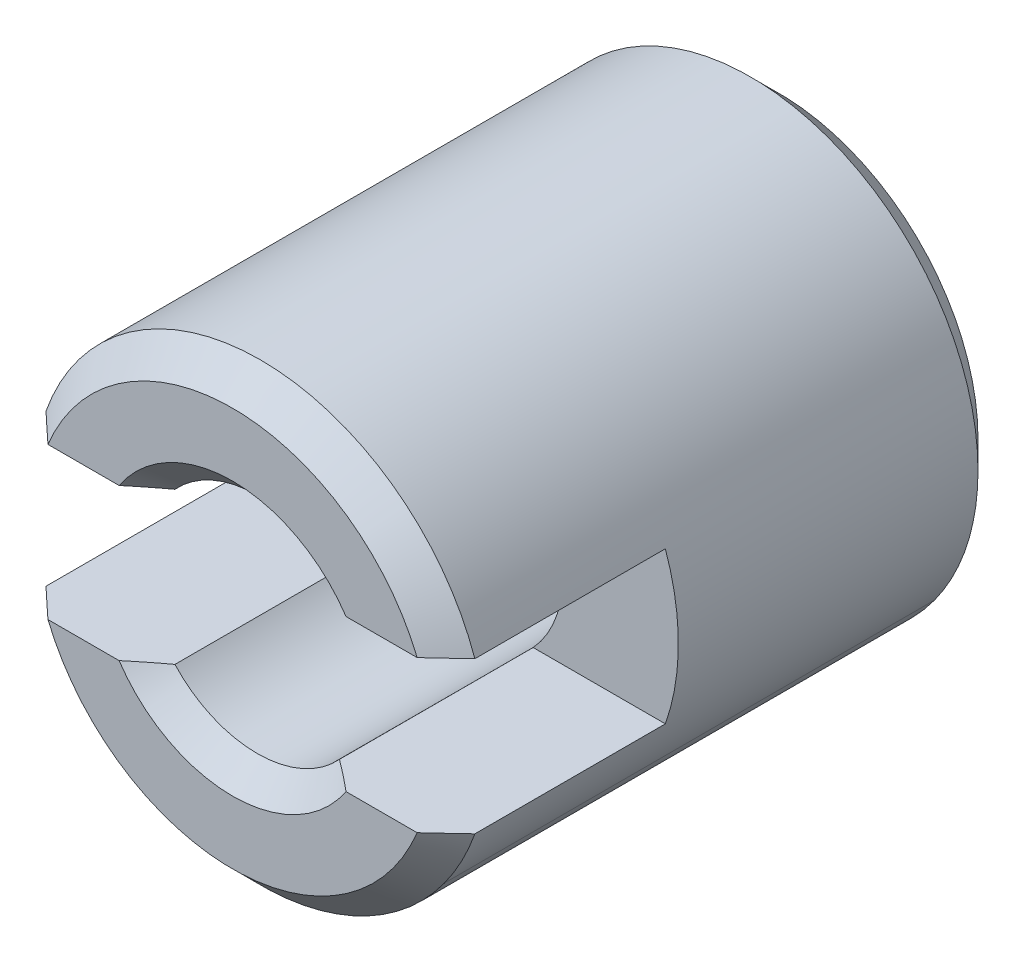
ISO-10303-21;
HEADER;
FILE_DESCRIPTION(('STEP AP214'),'2;1');
FILE_NAME('part.step','',(''),(''),'','','');
FILE_SCHEMA(('AUTOMOTIVE_DESIGN { 1 0 10303 214 1 1 1 1 }'));
ENDSEC;
DATA;
#1=APPLICATION_CONTEXT('core data for automotive mechanical design processes');
#2=APPLICATION_PROTOCOL_DEFINITION('international standard','automotive_design',2000,#1);
#3=PRODUCT_CONTEXT('',#1,'mechanical');
#4=PRODUCT('Part','Part','',(#3));
#5=PRODUCT_RELATED_PRODUCT_CATEGORY('part','',(#4));
#6=PRODUCT_DEFINITION_FORMATION('','',#4);
#7=PRODUCT_DEFINITION_CONTEXT('part definition',#1,'design');
#8=PRODUCT_DEFINITION('design','',#6,#7);
#9=PRODUCT_DEFINITION_SHAPE('','',#8);
#10=(LENGTH_UNIT() NAMED_UNIT(*) SI_UNIT(.MILLI.,.METRE.));
#11=(NAMED_UNIT(*) PLANE_ANGLE_UNIT() SI_UNIT($,.RADIAN.));
#12=(NAMED_UNIT(*) SI_UNIT($,.STERADIAN.) SOLID_ANGLE_UNIT());
#13=UNCERTAINTY_MEASURE_WITH_UNIT(LENGTH_MEASURE(1.E-05),#10,'distance_accuracy_value','');
#14=(GEOMETRIC_REPRESENTATION_CONTEXT(3) GLOBAL_UNCERTAINTY_ASSIGNED_CONTEXT((#13)) GLOBAL_UNIT_ASSIGNED_CONTEXT((#10,
#11,#12)) REPRESENTATION_CONTEXT('',''));
#15=CARTESIAN_POINT('',(0.,0.,0.));
#16=DIRECTION('',(0.,0.,1.));
#17=DIRECTION('',(1.,0.,0.));
#18=AXIS2_PLACEMENT_3D('',#15,#16,#17);
#19=CARTESIAN_POINT('',(0.,0.,3.));
#20=DIRECTION('',(0.,0.,-1.));
#21=DIRECTION('',(-1.,0.,0.));
#22=AXIS2_PLACEMENT_3D('',#19,#20,#21);
#23=PLANE('',#22);
#24=CARTESIAN_POINT('',(0.,0.,3.));
#25=DIRECTION('',(0.,0.,-1.));
#26=DIRECTION('',(-1.,0.,0.));
#27=AXIS2_PLACEMENT_3D('',#24,#25,#26);
#28=CIRCLE('',#27,2.1935);
#29=CARTESIAN_POINT('',(-2.0290386407251,0.83333333333333,3.));
#30=VERTEX_POINT('',#29);
#31=CARTESIAN_POINT('',(2.0290386407251,0.83333333333333,3.));
#32=VERTEX_POINT('',#31);
#33=EDGE_CURVE('E13',#30,#32,#28,.T.);
#34=ORIENTED_EDGE('',*,*,#33,.F.);
#35=DIRECTION('',(-1.,0.,0.));
#36=VECTOR('',#35,1.);
#37=CARTESIAN_POINT('',(3.,0.83333333333333,3.));
#38=LINE('',#37,#36);
#39=CARTESIAN_POINT('',(-1.24721912892465,0.83333333333333,3.));
#40=VERTEX_POINT('',#39);
#41=EDGE_CURVE('E33',#40,#30,#38,.T.);
#42=ORIENTED_EDGE('',*,*,#41,.F.);
#43=CARTESIAN_POINT('',(0.,0.,3.));
#44=DIRECTION('',(0.,0.,-1.));
#45=DIRECTION('',(-1.,0.,0.));
#46=AXIS2_PLACEMENT_3D('',#43,#44,#45);
#47=CIRCLE('',#46,1.5);
#48=CARTESIAN_POINT('',(1.24721912892465,0.83333333333333,3.));
#49=VERTEX_POINT('',#48);
#50=EDGE_CURVE('E296',#40,#49,#47,.T.);
#51=ORIENTED_EDGE('',*,*,#50,.T.);
#52=DIRECTION('',(-1.,0.,0.));
#53=VECTOR('',#52,1.);
#54=CARTESIAN_POINT('',(3.,0.83333333333333,3.));
#55=LINE('',#54,#53);
#56=EDGE_CURVE('E293',#32,#49,#55,.T.);
#57=ORIENTED_EDGE('',*,*,#56,.F.);
#58=EDGE_LOOP('',(#34,#42,#51,#57));
#59=FACE_BOUND('',#58,.T.);
#60=ADVANCED_FACE('F25',(#59),#23,.F.);
#61=CARTESIAN_POINT('',(3.,0.83333333333333,0.6));
#62=DIRECTION('',(0.,1.,0.));
#63=DIRECTION('',(0.,0.,1.));
#64=AXIS2_PLACEMENT_3D('',#61,#62,#63);
#65=PLANE('',#64);
#66=ORIENTED_EDGE('',*,*,#56,.T.);
#67=CARTESIAN_POINT('',(1.24721912892465,0.83333333333333,3.));
#68=CARTESIAN_POINT('',(1.13521834904477,0.83333333333333,2.90687365658622));
#69=CARTESIAN_POINT('',(1.02135791134346,0.83333333333333,2.81578490080694));
#70=CARTESIAN_POINT('',(0.904005423410479,0.83333333333333,2.7295));
#71=B_SPLINE_CURVE_WITH_KNOTS('',3,(#67,#68,#69,#70),.UNSPECIFIED.,.F.,.F.,(4,4),(0.,1.),.UNSPECIFIED.);
#72=CARTESIAN_POINT('',(0.90400542341048,0.83333333333333,2.7295));
#73=VERTEX_POINT('',#72);
#74=EDGE_CURVE('E289',#49,#73,#71,.T.);
#75=ORIENTED_EDGE('',*,*,#74,.T.);
#76=DIRECTION('',(0.,0.,-1.));
#77=VECTOR('',#76,1.);
#78=CARTESIAN_POINT('',(0.90400542341048,0.83333333333333,-3.));
#79=LINE('',#78,#77);
#80=CARTESIAN_POINT('',(0.90400542341048,0.83333333333333,0.6));
#81=VERTEX_POINT('',#80);
#82=EDGE_CURVE('E286',#73,#81,#79,.T.);
#83=ORIENTED_EDGE('',*,*,#82,.T.);
#84=DIRECTION('',(-1.,0.,0.));
#85=VECTOR('',#84,1.);
#86=CARTESIAN_POINT('',(3.,0.83333333333333,0.6));
#87=LINE('',#86,#85);
#88=CARTESIAN_POINT('',(2.35702260395516,0.83333333333333,0.6));
#89=VERTEX_POINT('',#88);
#90=EDGE_CURVE('E281',#89,#81,#87,.T.);
#91=ORIENTED_EDGE('',*,*,#90,.F.);
#92=DIRECTION('',(0.,0.,-1.));
#93=VECTOR('',#92,1.);
#94=CARTESIAN_POINT('',(2.35702260395516,0.83333333333333,-3.));
#95=LINE('',#94,#93);
#96=CARTESIAN_POINT('',(2.35702260395516,0.83333333333333,2.6935));
#97=VERTEX_POINT('',#96);
#98=EDGE_CURVE('E278',#97,#89,#95,.T.);
#99=ORIENTED_EDGE('',*,*,#98,.F.);
#100=CARTESIAN_POINT('',(2.0290386407251,0.83333333333333,3.));
#101=CARTESIAN_POINT('',(2.04276747696056,0.833333245417463,2.98730052128797));
#102=CARTESIAN_POINT('',(2.05648727564378,0.833332001331377,2.97459127489064));
#103=CARTESIAN_POINT('',(2.08391126962283,0.833328551725975,2.94915234520499));
#104=CARTESIAN_POINT('',(2.09761546262992,0.833326346080269,2.93642265944929));
#105=CARTESIAN_POINT('',(2.12500823009279,0.833322324831757,2.91094424495844));
#106=CARTESIAN_POINT('',(2.13869680317585,0.833320509260945,2.89819551474747));
#107=CARTESIAN_POINT('',(2.16605841819426,0.83331799437191,2.8726804165446));
#108=CARTESIAN_POINT('',(2.17973145955533,0.8333172950937,2.85991404793685));
#109=CARTESIAN_POINT('',(2.20706217879673,0.833317279013261,2.83436507509904));
#110=CARTESIAN_POINT('',(2.22071985678771,0.833317962201012,2.82158247098734));
#111=CARTESIAN_POINT('',(2.24802009565918,0.833320456154268,2.79600243068744));
#112=CARTESIAN_POINT('',(2.2616626572276,0.833322266866155,2.7832049952334));
#113=CARTESIAN_POINT('',(2.28893297872338,0.83332629483274,2.75759669370357));
#114=CARTESIAN_POINT('',(2.30256073981397,0.833328512052749,2.74478582886644));
#115=CARTESIAN_POINT('',(2.32980185031112,0.83333198522228,2.71915207731833));
#116=CARTESIAN_POINT('',(2.34341520125849,0.833333241287783,2.70632919224483));
#117=CARTESIAN_POINT('',(2.35702260395516,0.833333333333327,2.6935));
#118=B_SPLINE_CURVE_WITH_KNOTS('',3,(#100,#101,#102,#103,#104,#105,#106,#107,#108,#109,#110,
#111,#112,#113,#114,#115,#116,#117),.UNSPECIFIED.,.F.,.F.,(4,2,2,2,2,2,2,2,4),(0.,
0.0561054234068252,0.112218223657179,0.16833562472664,0.224455037279045,0.280574043030872,
0.336690380339389,0.39280193125109,0.448906710252808),.UNSPECIFIED.);
#119=EDGE_CURVE('E277',#32,#97,#118,.T.);
#120=ORIENTED_EDGE('',*,*,#119,.F.);
#121=EDGE_LOOP('',(#66,#75,#83,#91,#99,#120));
#122=FACE_BOUND('',#121,.T.);
#123=ADVANCED_FACE('F240',(#122),#65,.F.);
#124=CARTESIAN_POINT('',(0.,0.,3.));
#125=DIRECTION('',(0.,0.,-1.));
#126=DIRECTION('',(0.,-1.,0.));
#127=AXIS2_PLACEMENT_3D('',#124,#125,#126);
#128=CONICAL_SURFACE('',#127,2.1935,0.785398163397448);
#129=CARTESIAN_POINT('',(0.,0.,2.6935));
#130=DIRECTION('',(0.,0.,-1.));
#131=DIRECTION('',(-1.,0.,0.));
#132=AXIS2_PLACEMENT_3D('',#129,#130,#131);
#133=CIRCLE('',#132,2.5);
#134=CARTESIAN_POINT('',(-2.35702260395516,0.83333333333333,2.6935));
#135=VERTEX_POINT('',#134);
#136=EDGE_CURVE('E577',#135,#97,#133,.T.);
#137=ORIENTED_EDGE('',*,*,#136,.F.);
#138=CARTESIAN_POINT('',(-2.35702260395516,0.83333333333333,2.6935));
#139=CARTESIAN_POINT('',(-2.34341324163033,0.833333237256594,2.706331040858));
#140=CARTESIAN_POINT('',(-2.32979793961716,0.833331916722452,2.71915578363801));
#141=CARTESIAN_POINT('',(-2.30255462264687,0.833328263882748,2.74479166548166));
#142=CARTESIAN_POINT('',(-2.28892660773333,0.833325931580641,2.7576028045916));
#143=CARTESIAN_POINT('',(-2.26165689935764,0.833321692322036,2.78321059589856));
#144=CARTESIAN_POINT('',(-2.24801520585636,0.833319785366759,2.79600724805392));
#145=CARTESIAN_POINT('',(-2.22071725346792,0.833317156653205,2.82158519025416));
#146=CARTESIAN_POINT('',(-2.20706099448445,0.833316434902815,2.83436648019626));
#147=CARTESIAN_POINT('',(-2.17973309707886,0.833316446711615,2.85991282026779));
#148=CARTESIAN_POINT('',(-2.16606145853884,0.833317180282041,2.8726778702711));
#149=CARTESIAN_POINT('',(-2.13870207130552,0.833319824375346,2.89819085417234));
#150=CARTESIAN_POINT('',(-2.125014322519,0.83332173490507,2.9109387879703));
#151=CARTESIAN_POINT('',(-2.09762206892223,0.833325969237575,2.93641665941902));
#152=CARTESIAN_POINT('',(-2.08391756410098,0.833328293040628,2.94914659705796));
#153=CARTESIAN_POINT('',(-2.05649126259197,0.833331928561788,2.97458760910583));
#154=CARTESIAN_POINT('',(-2.04276946604455,0.833333240288055,2.98729868366604));
#155=CARTESIAN_POINT('',(-2.0290386407251,0.83333333333333,3.));
#156=B_SPLINE_CURVE_WITH_KNOTS('',3,(#138,#139,#140,#141,#142,#143,#144,#145,#146,#147,#148,
#149,#150,#151,#152,#153,#154,#155),.UNSPECIFIED.,.F.,.F.,(4,2,2,2,2,2,2,2,4),(0.,
0.0561128609499753,0.112225530297001,0.168338360590454,0.224451564197321,0.280565200983781,
0.336679164088235,0.392793164045295,0.448906711515749),.UNSPECIFIED.);
#157=EDGE_CURVE('E308',#135,#30,#156,.T.);
#158=ORIENTED_EDGE('',*,*,#157,.T.);
#159=ORIENTED_EDGE('',*,*,#33,.T.);
#160=ORIENTED_EDGE('',*,*,#119,.T.);
#161=EDGE_LOOP('',(#137,#158,#159,#160));
#162=FACE_BOUND('',#161,.T.);
#163=ADVANCED_FACE('F244',(#162),#128,.T.);
#164=CARTESIAN_POINT('',(3.,0.83333333333333,0.6));
#165=DIRECTION('',(0.,1.,0.));
#166=DIRECTION('',(0.,0.,1.));
#167=AXIS2_PLACEMENT_3D('',#164,#165,#166);
#168=PLANE('',#167);
#169=DIRECTION('',(0.,0.,1.));
#170=VECTOR('',#169,1.);
#171=CARTESIAN_POINT('',(-2.35702260395516,0.83333333333333,-3.));
#172=LINE('',#171,#170);
#173=CARTESIAN_POINT('',(-2.35702260395516,0.83333333333333,0.6));
#174=VERTEX_POINT('',#173);
#175=EDGE_CURVE('E592',#174,#135,#172,.T.);
#176=ORIENTED_EDGE('',*,*,#175,.F.);
#177=DIRECTION('',(-1.,0.,0.));
#178=VECTOR('',#177,1.);
#179=CARTESIAN_POINT('',(3.,0.83333333333333,0.6));
#180=LINE('',#179,#178);
#181=CARTESIAN_POINT('',(-0.90400542341048,0.83333333333333,0.6));
#182=VERTEX_POINT('',#181);
#183=EDGE_CURVE('E593',#182,#174,#180,.T.);
#184=ORIENTED_EDGE('',*,*,#183,.F.);
#185=DIRECTION('',(0.,0.,1.));
#186=VECTOR('',#185,1.);
#187=CARTESIAN_POINT('',(-0.90400542341048,0.83333333333333,-3.));
#188=LINE('',#187,#186);
#189=CARTESIAN_POINT('',(-0.90400542341048,0.83333333333333,2.7295));
#190=VERTEX_POINT('',#189);
#191=EDGE_CURVE('E316',#182,#190,#188,.T.);
#192=ORIENTED_EDGE('',*,*,#191,.T.);
#193=CARTESIAN_POINT('',(-0.90400542341048,0.83333333333333,2.7295));
#194=CARTESIAN_POINT('',(-1.02129945651928,0.83333333333333,2.81574192115823));
#195=CARTESIAN_POINT('',(-1.13527413811248,0.83333333333333,2.90692004404785));
#196=CARTESIAN_POINT('',(-1.24721912892465,0.83333333333333,3.));
#197=B_SPLINE_CURVE_WITH_KNOTS('',3,(#193,#194,#195,#196),.UNSPECIFIED.,.F.,.F.,(4,4),(0.,1.),.UNSPECIFIED.);
#198=EDGE_CURVE('E312',#190,#40,#197,.T.);
#199=ORIENTED_EDGE('',*,*,#198,.T.);
#200=ORIENTED_EDGE('',*,*,#41,.T.);
#201=ORIENTED_EDGE('',*,*,#157,.F.);
#202=EDGE_LOOP('',(#176,#184,#192,#199,#200,#201));
#203=FACE_BOUND('',#202,.T.);
#204=ADVANCED_FACE('F249',(#203),#168,.F.);
#205=CARTESIAN_POINT('',(0.,0.,3.));
#206=DIRECTION('',(0.,0.,1.));
#207=DIRECTION('',(0.,-1.,0.));
#208=AXIS2_PLACEMENT_3D('',#205,#206,#207);
#209=CONICAL_SURFACE('',#208,1.5,0.785398163397448);
#210=ORIENTED_EDGE('',*,*,#74,.F.);
#211=ORIENTED_EDGE('',*,*,#50,.F.);
#212=ORIENTED_EDGE('',*,*,#198,.F.);
#213=CARTESIAN_POINT('',(0.,0.,2.7295));
#214=DIRECTION('',(0.,0.,-1.));
#215=DIRECTION('',(-1.,0.,0.));
#216=AXIS2_PLACEMENT_3D('',#213,#214,#215);
#217=CIRCLE('',#216,1.2295);
#218=EDGE_CURVE('E320',#190,#73,#217,.T.);
#219=ORIENTED_EDGE('',*,*,#218,.T.);
#220=EDGE_LOOP('',(#210,#211,#212,#219));
#221=FACE_BOUND('',#220,.T.);
#222=ADVANCED_FACE('F323',(#221),#209,.F.);
#223=CARTESIAN_POINT('',(0.,0.,-3.));
#224=DIRECTION('',(0.,0.,-1.));
#225=DIRECTION('',(0.,-1.,0.));
#226=AXIS2_PLACEMENT_3D('',#223,#224,#225);
#227=CYLINDRICAL_SURFACE('',#226,1.2295);
#228=DIRECTION('',(0.,0.,-1.));
#229=VECTOR('',#228,1.);
#230=CARTESIAN_POINT('',(1.2295,0.,0.6));
#231=LINE('',#230,#229);
#232=CARTESIAN_POINT('',(1.2295,0.,0.6));
#233=VERTEX_POINT('',#232);
#234=CARTESIAN_POINT('',(1.2295,0.,-2.7295));
#235=VERTEX_POINT('',#234);
#236=EDGE_CURVE('E365',#233,#235,#231,.T.);
#237=ORIENTED_EDGE('',*,*,#236,.F.);
#238=CARTESIAN_POINT('',(0.,0.,0.6));
#239=DIRECTION('',(0.,0.,1.));
#240=DIRECTION('',(1.,0.,0.));
#241=AXIS2_PLACEMENT_3D('',#238,#239,#240);
#242=CIRCLE('',#241,1.2295);
#243=EDGE_CURVE('E370',#233,#81,#242,.T.);
#244=ORIENTED_EDGE('',*,*,#243,.T.);
#245=ORIENTED_EDGE('',*,*,#82,.F.);
#246=ORIENTED_EDGE('',*,*,#218,.F.);
#247=ORIENTED_EDGE('',*,*,#191,.F.);
#248=CARTESIAN_POINT('',(0.,0.,0.6));
#249=DIRECTION('',(0.,0.,1.));
#250=DIRECTION('',(1.,0.,0.));
#251=AXIS2_PLACEMENT_3D('',#248,#249,#250);
#252=CIRCLE('',#251,1.2295);
#253=CARTESIAN_POINT('',(-1.2295,0.,0.6));
#254=VERTEX_POINT('',#253);
#255=EDGE_CURVE('E374',#182,#254,#252,.T.);
#256=ORIENTED_EDGE('',*,*,#255,.T.);
#257=DIRECTION('',(0.,0.,-1.));
#258=VECTOR('',#257,1.);
#259=CARTESIAN_POINT('',(-1.2295,0.,0.6));
#260=LINE('',#259,#258);
#261=CARTESIAN_POINT('',(-1.2295,0.,-2.7295));
#262=VERTEX_POINT('',#261);
#263=EDGE_CURVE('E378',#254,#262,#260,.T.);
#264=ORIENTED_EDGE('',*,*,#263,.T.);
#265=CARTESIAN_POINT('',(0.,0.,-2.7295));
#266=DIRECTION('',(0.,0.,-1.));
#267=DIRECTION('',(-1.,0.,0.));
#268=AXIS2_PLACEMENT_3D('',#265,#266,#267);
#269=CIRCLE('',#268,1.2295);
#270=EDGE_CURVE('E382',#262,#235,#269,.T.);
#271=ORIENTED_EDGE('',*,*,#270,.T.);
#272=EDGE_LOOP('',(#237,#244,#245,#246,#247,#256,#264,#271));
#273=FACE_BOUND('',#272,.T.);
#274=ADVANCED_FACE('F350',(#273),#227,.F.);
#275=CARTESIAN_POINT('',(0.,0.,-2.7295));
#276=DIRECTION('',(0.,0.,-1.));
#277=DIRECTION('',(0.,-1.,0.));
#278=AXIS2_PLACEMENT_3D('',#275,#276,#277);
#279=CONICAL_SURFACE('',#278,1.2295,0.785398163397448);
#280=DIRECTION('',(0.707106781186547,0.,-0.707106781186548));
#281=VECTOR('',#280,1.);
#282=CARTESIAN_POINT('',(1.2295,0.,-2.7295));
#283=LINE('',#282,#281);
#284=CARTESIAN_POINT('',(1.5,0.,-3.));
#285=VERTEX_POINT('',#284);
#286=EDGE_CURVE('E386',#235,#285,#283,.T.);
#287=ORIENTED_EDGE('',*,*,#286,.F.);
#288=ORIENTED_EDGE('',*,*,#270,.F.);
#289=DIRECTION('',(-0.707106781186547,0.,-0.707106781186548));
#290=VECTOR('',#289,1.);
#291=CARTESIAN_POINT('',(-1.2295,0.,-2.7295));
#292=LINE('',#291,#290);
#293=CARTESIAN_POINT('',(-1.5,0.,-3.));
#294=VERTEX_POINT('',#293);
#295=EDGE_CURVE('E391',#262,#294,#292,.T.);
#296=ORIENTED_EDGE('',*,*,#295,.T.);
#297=CARTESIAN_POINT('',(0.,0.,-3.));
#298=DIRECTION('',(0.,0.,-1.));
#299=DIRECTION('',(-1.,0.,0.));
#300=AXIS2_PLACEMENT_3D('',#297,#298,#299);
#301=CIRCLE('',#300,1.5);
#302=EDGE_CURVE('E395',#294,#285,#301,.T.);
#303=ORIENTED_EDGE('',*,*,#302,.T.);
#304=EDGE_LOOP('',(#287,#288,#296,#303));
#305=FACE_BOUND('',#304,.T.);
#306=ADVANCED_FACE('F624',(#305),#279,.F.);
#307=CARTESIAN_POINT('',(0.,2.1935,-3.));
#308=DIRECTION('',(0.,0.,1.));
#309=DIRECTION('',(1.,0.,0.));
#310=AXIS2_PLACEMENT_3D('',#307,#308,#309);
#311=PLANE('',#310);
#312=CARTESIAN_POINT('',(0.,0.,-3.));
#313=DIRECTION('',(0.,0.,-1.));
#314=DIRECTION('',(-1.,0.,0.));
#315=AXIS2_PLACEMENT_3D('',#312,#313,#314);
#316=CIRCLE('',#315,1.5);
#317=EDGE_CURVE('E399',#285,#294,#316,.T.);
#318=ORIENTED_EDGE('',*,*,#317,.F.);
#319=ORIENTED_EDGE('',*,*,#302,.F.);
#320=EDGE_LOOP('',(#318,#319));
#321=FACE_BOUND('',#320,.T.);
#322=CARTESIAN_POINT('',(0.,0.,-3.));
#323=DIRECTION('',(0.,0.,-1.));
#324=DIRECTION('',(-1.,0.,0.));
#325=AXIS2_PLACEMENT_3D('',#322,#323,#324);
#326=CIRCLE('',#325,2.1935);
#327=CARTESIAN_POINT('',(-2.1935,0.,-3.));
#328=VERTEX_POINT('',#327);
#329=CARTESIAN_POINT('',(2.1935,0.,-3.));
#330=VERTEX_POINT('',#329);
#331=EDGE_CURVE('E404',#328,#330,#326,.T.);
#332=ORIENTED_EDGE('',*,*,#331,.T.);
#333=CARTESIAN_POINT('',(0.,0.,-3.));
#334=DIRECTION('',(0.,0.,-1.));
#335=DIRECTION('',(-1.,0.,0.));
#336=AXIS2_PLACEMENT_3D('',#333,#334,#335);
#337=CIRCLE('',#336,2.1935);
#338=EDGE_CURVE('E408',#330,#328,#337,.T.);
#339=ORIENTED_EDGE('',*,*,#338,.T.);
#340=EDGE_LOOP('',(#332,#339));
#341=FACE_BOUND('',#340,.T.);
#342=ADVANCED_FACE('F628',(#321,#341),#311,.F.);
#343=CARTESIAN_POINT('',(0.,0.,-2.6935));
#344=DIRECTION('',(0.,0.,1.));
#345=DIRECTION('',(0.,1.,0.));
#346=AXIS2_PLACEMENT_3D('',#343,#344,#345);
#347=CONICAL_SURFACE('',#346,2.5,0.785398163397447);
#348=DIRECTION('',(-0.707106781186547,0.,0.707106781186549));
#349=VECTOR('',#348,1.);
#350=CARTESIAN_POINT('',(-2.1935,0.,-3.));
#351=LINE('',#350,#349);
#352=CARTESIAN_POINT('',(-2.5,0.,-2.6935));
#353=VERTEX_POINT('',#352);
#354=EDGE_CURVE('E412',#328,#353,#351,.T.);
#355=ORIENTED_EDGE('',*,*,#354,.F.);
#356=ORIENTED_EDGE('',*,*,#338,.F.);
#357=DIRECTION('',(0.707106781186547,0.,0.707106781186549));
#358=VECTOR('',#357,1.);
#359=CARTESIAN_POINT('',(2.1935,0.,-3.));
#360=LINE('',#359,#358);
#361=CARTESIAN_POINT('',(2.5,0.,-2.6935));
#362=VERTEX_POINT('',#361);
#363=EDGE_CURVE('E416',#330,#362,#360,.T.);
#364=ORIENTED_EDGE('',*,*,#363,.T.);
#365=CARTESIAN_POINT('',(0.,0.,-2.6935));
#366=DIRECTION('',(0.,0.,-1.));
#367=DIRECTION('',(-1.,0.,0.));
#368=AXIS2_PLACEMENT_3D('',#365,#366,#367);
#369=CIRCLE('',#368,2.5);
#370=CARTESIAN_POINT('',(2.02254248593737,-1.46946313073118,-2.6935));
#371=VERTEX_POINT('',#370);
#372=EDGE_CURVE('E420',#362,#371,#369,.T.);
#373=ORIENTED_EDGE('',*,*,#372,.T.);
#374=CARTESIAN_POINT('',(0.,0.,-2.6935));
#375=DIRECTION('',(0.,0.,-1.));
#376=DIRECTION('',(-1.,0.,0.));
#377=AXIS2_PLACEMENT_3D('',#374,#375,#376);
#378=CIRCLE('',#377,2.5);
#379=EDGE_CURVE('E424',#371,#353,#378,.T.);
#380=ORIENTED_EDGE('',*,*,#379,.T.);
#381=EDGE_LOOP('',(#355,#356,#364,#373,#380));
#382=FACE_BOUND('',#381,.T.);
#383=ADVANCED_FACE('F631',(#382),#347,.T.);
#384=CARTESIAN_POINT('',(0.,0.,-3.));
#385=DIRECTION('',(0.,0.,-1.));
#386=DIRECTION('',(0.309016994374947,0.951056516295154,0.));
#387=AXIS2_PLACEMENT_3D('',#384,#385,#386);
#388=CYLINDRICAL_SURFACE('',#387,2.5);
#389=DIRECTION('',(0.,0.,-1.));
#390=VECTOR('',#389,1.);
#391=CARTESIAN_POINT('',(2.02254248593737,-1.46946313073118,2.6935));
#392=LINE('',#391,#390);
#393=CARTESIAN_POINT('',(2.02254248593737,-1.46946313073118,2.6935));
#394=VERTEX_POINT('',#393);
#395=EDGE_CURVE('E428',#394,#371,#392,.T.);
#396=ORIENTED_EDGE('',*,*,#395,.F.);
#397=CARTESIAN_POINT('',(0.,0.,2.6935));
#398=DIRECTION('',(0.,0.,-1.));
#399=DIRECTION('',(-1.,0.,0.));
#400=AXIS2_PLACEMENT_3D('',#397,#398,#399);
#401=CIRCLE('',#400,2.5);
#402=CARTESIAN_POINT('',(-2.35702260395516,-0.83333333333333,2.6935));
#403=VERTEX_POINT('',#402);
#404=EDGE_CURVE('E433',#394,#403,#401,.T.);
#405=ORIENTED_EDGE('',*,*,#404,.T.);
#406=DIRECTION('',(0.,0.,-1.));
#407=VECTOR('',#406,1.);
#408=CARTESIAN_POINT('',(-2.35702260395516,-0.83333333333333,-3.));
#409=LINE('',#408,#407);
#410=CARTESIAN_POINT('',(-2.35702260395516,-0.83333333333333,0.6));
#411=VERTEX_POINT('',#410);
#412=EDGE_CURVE('E437',#403,#411,#409,.T.);
#413=ORIENTED_EDGE('',*,*,#412,.T.);
#414=CARTESIAN_POINT('',(0.,0.,0.6));
#415=DIRECTION('',(0.,0.,1.));
#416=DIRECTION('',(1.,0.,0.));
#417=AXIS2_PLACEMENT_3D('',#414,#415,#416);
#418=CIRCLE('',#417,2.5);
#419=CARTESIAN_POINT('',(-2.5,0.,0.6));
#420=VERTEX_POINT('',#419);
#421=EDGE_CURVE('E441',#420,#411,#418,.T.);
#422=ORIENTED_EDGE('',*,*,#421,.F.);
#423=DIRECTION('',(0.,0.,-1.));
#424=VECTOR('',#423,1.);
#425=CARTESIAN_POINT('',(-2.5,0.,0.6));
#426=LINE('',#425,#424);
#427=EDGE_CURVE('E446',#420,#353,#426,.T.);
#428=ORIENTED_EDGE('',*,*,#427,.T.);
#429=ORIENTED_EDGE('',*,*,#379,.F.);
#430=EDGE_LOOP('',(#396,#405,#413,#422,#428,#429));
#431=FACE_BOUND('',#430,.T.);
#432=ADVANCED_FACE('F612',(#431),#388,.T.);
#433=CARTESIAN_POINT('',(0.,0.,-3.));
#434=DIRECTION('',(0.,0.,-1.));
#435=DIRECTION('',(-0.309016994374947,-0.951056516295154,0.));
#436=AXIS2_PLACEMENT_3D('',#433,#434,#435);
#437=CYLINDRICAL_SURFACE('',#436,2.5);
#438=ORIENTED_EDGE('',*,*,#395,.T.);
#439=ORIENTED_EDGE('',*,*,#372,.F.);
#440=CARTESIAN_POINT('',(0.,0.,-2.6935));
#441=DIRECTION('',(0.,0.,-1.));
#442=DIRECTION('',(-1.,0.,0.));
#443=AXIS2_PLACEMENT_3D('',#440,#441,#442);
#444=CIRCLE('',#443,2.5);
#445=EDGE_CURVE('E451',#353,#362,#444,.T.);
#446=ORIENTED_EDGE('',*,*,#445,.F.);
#447=ORIENTED_EDGE('',*,*,#427,.F.);
#448=CARTESIAN_POINT('',(0.,0.,0.6));
#449=DIRECTION('',(0.,0.,1.));
#450=DIRECTION('',(1.,0.,0.));
#451=AXIS2_PLACEMENT_3D('',#448,#449,#450);
#452=CIRCLE('',#451,2.5);
#453=EDGE_CURVE('E456',#174,#420,#452,.T.);
#454=ORIENTED_EDGE('',*,*,#453,.F.);
#455=ORIENTED_EDGE('',*,*,#175,.T.);
#456=ORIENTED_EDGE('',*,*,#136,.T.);
#457=ORIENTED_EDGE('',*,*,#98,.T.);
#458=CARTESIAN_POINT('',(0.,0.,0.6));
#459=DIRECTION('',(0.,0.,1.));
#460=DIRECTION('',(1.,0.,0.));
#461=AXIS2_PLACEMENT_3D('',#458,#459,#460);
#462=CIRCLE('',#461,2.5);
#463=CARTESIAN_POINT('',(2.35702260395516,-0.83333333333333,0.6));
#464=VERTEX_POINT('',#463);
#465=EDGE_CURVE('E461',#464,#89,#462,.T.);
#466=ORIENTED_EDGE('',*,*,#465,.F.);
#467=DIRECTION('',(0.,0.,1.));
#468=VECTOR('',#467,1.);
#469=CARTESIAN_POINT('',(2.35702260395516,-0.83333333333333,-3.));
#470=LINE('',#469,#468);
#471=CARTESIAN_POINT('',(2.35702260395516,-0.83333333333333,2.6935));
#472=VERTEX_POINT('',#471);
#473=EDGE_CURVE('E466',#464,#472,#470,.T.);
#474=ORIENTED_EDGE('',*,*,#473,.T.);
#475=CARTESIAN_POINT('',(0.,0.,2.6935));
#476=DIRECTION('',(0.,0.,-1.));
#477=DIRECTION('',(-1.,0.,0.));
#478=AXIS2_PLACEMENT_3D('',#475,#476,#477);
#479=CIRCLE('',#478,2.5);
#480=EDGE_CURVE('E470',#472,#394,#479,.T.);
#481=ORIENTED_EDGE('',*,*,#480,.T.);
#482=EDGE_LOOP('',(#438,#439,#446,#447,#454,#455,#456,#457,#466,#474,#481));
#483=FACE_BOUND('',#482,.T.);
#484=ADVANCED_FACE('F496',(#483),#437,.T.);
#485=CARTESIAN_POINT('',(0.,0.,3.));
#486=DIRECTION('',(0.,0.,-1.));
#487=DIRECTION('',(0.,1.,0.));
#488=AXIS2_PLACEMENT_3D('',#485,#486,#487);
#489=CONICAL_SURFACE('',#488,2.1935,0.785398163397448);
#490=ORIENTED_EDGE('',*,*,#404,.F.);
#491=ORIENTED_EDGE('',*,*,#480,.F.);
#492=CARTESIAN_POINT('',(2.35702260395516,-0.83333333333333,2.6935));
#493=CARTESIAN_POINT('',(2.34341324163033,-0.833333237256595,2.70633104085799));
#494=CARTESIAN_POINT('',(2.32979793961716,-0.833331916722452,2.71915578363801));
#495=CARTESIAN_POINT('',(2.30255462264687,-0.833328263882748,2.74479166548166));
#496=CARTESIAN_POINT('',(2.28892660773333,-0.83332593158064,2.7576028045916));
#497=CARTESIAN_POINT('',(2.26165689935764,-0.833321692322036,2.78321059589856));
#498=CARTESIAN_POINT('',(2.24801520585636,-0.833319785366759,2.79600724805392));
#499=CARTESIAN_POINT('',(2.22071725346792,-0.833317156653206,2.82158519025416));
#500=CARTESIAN_POINT('',(2.20706099448445,-0.833316434902816,2.83436648019626));
#501=CARTESIAN_POINT('',(2.17973309707886,-0.833316446711617,2.85991282026779));
#502=CARTESIAN_POINT('',(2.16606145853884,-0.833317180282042,2.8726778702711));
#503=CARTESIAN_POINT('',(2.13870207130552,-0.833319824375348,2.89819085417234));
#504=CARTESIAN_POINT('',(2.125014322519,-0.833321734905073,2.9109387879703));
#505=CARTESIAN_POINT('',(2.09762206892223,-0.833325969237579,2.93641665941902));
#506=CARTESIAN_POINT('',(2.08391756410097,-0.833328293040632,2.94914659705796));
#507=CARTESIAN_POINT('',(2.05649126259197,-0.833331928561792,2.97458760910583));
#508=CARTESIAN_POINT('',(2.04276946604455,-0.833333240288059,2.98729868366604));
#509=CARTESIAN_POINT('',(2.0290386407251,-0.833333333333335,3.));
#510=B_SPLINE_CURVE_WITH_KNOTS('',3,(#492,#493,#494,#495,#496,#497,#498,#499,#500,#501,#502,
#503,#504,#505,#506,#507,#508,#509),.UNSPECIFIED.,.F.,.F.,(4,2,2,2,2,2,2,2,4),(0.,
0.0561128609499756,0.112225530297002,0.168338360590455,0.224451564197321,0.280565200983782,
0.336679164088237,0.392793164045296,0.448906711515751),.UNSPECIFIED.);
#511=CARTESIAN_POINT('',(2.0290386407251,-0.83333333333333,3.));
#512=VERTEX_POINT('',#511);
#513=EDGE_CURVE('E475',#472,#512,#510,.T.);
#514=ORIENTED_EDGE('',*,*,#513,.T.);
#515=CARTESIAN_POINT('',(0.,0.,3.));
#516=DIRECTION('',(0.,0.,-1.));
#517=DIRECTION('',(-1.,0.,0.));
#518=AXIS2_PLACEMENT_3D('',#515,#516,#517);
#519=CIRCLE('',#518,2.1935);
#520=CARTESIAN_POINT('',(-2.0290386407251,-0.83333333333333,3.));
#521=VERTEX_POINT('',#520);
#522=EDGE_CURVE('E177',#512,#521,#519,.T.);
#523=ORIENTED_EDGE('',*,*,#522,.T.);
#524=CARTESIAN_POINT('',(-2.0290386407251,-0.833333333333331,3.));
#525=CARTESIAN_POINT('',(-2.04276747696056,-0.833333245417466,2.98730052128797));
#526=CARTESIAN_POINT('',(-2.05648727564378,-0.83333200133138,2.97459127489064));
#527=CARTESIAN_POINT('',(-2.08391126962283,-0.833328551725976,2.94915234520499));
#528=CARTESIAN_POINT('',(-2.09761546262992,-0.833326346080269,2.93642265944929));
#529=CARTESIAN_POINT('',(-2.12500823009279,-0.833322324831757,2.91094424495844));
#530=CARTESIAN_POINT('',(-2.13869680317585,-0.833320509260946,2.89819551474747));
#531=CARTESIAN_POINT('',(-2.16605841819426,-0.833317994371913,2.8726804165446));
#532=CARTESIAN_POINT('',(-2.17973145955533,-0.833317295093704,2.85991404793685));
#533=CARTESIAN_POINT('',(-2.20706217879673,-0.833317279013266,2.83436507509904));
#534=CARTESIAN_POINT('',(-2.22071985678771,-0.833317962201015,2.82158247098734));
#535=CARTESIAN_POINT('',(-2.24802009565918,-0.833320456154269,2.79600243068744));
#536=CARTESIAN_POINT('',(-2.2616626572276,-0.833322266866157,2.7832049952334));
#537=CARTESIAN_POINT('',(-2.28893297872338,-0.833326294832743,2.75759669370357));
#538=CARTESIAN_POINT('',(-2.30256073981397,-0.833328512052752,2.74478582886643));
#539=CARTESIAN_POINT('',(-2.32980185031112,-0.833331985222283,2.71915207731833));
#540=CARTESIAN_POINT('',(-2.34341520125849,-0.833333241287786,2.70632919224483));
#541=CARTESIAN_POINT('',(-2.35702260395516,-0.833333333333332,2.6935));
#542=B_SPLINE_CURVE_WITH_KNOTS('',3,(#524,#525,#526,#527,#528,#529,#530,#531,#532,#533,#534,
#535,#536,#537,#538,#539,#540,#541),.UNSPECIFIED.,.F.,.F.,(4,2,2,2,2,2,2,2,4),(0.,
0.0561054234068245,0.112218223657179,0.168335624726639,0.224455037279045,0.280574043030871,
0.336690380339389,0.392801931251091,0.448906710252807),.UNSPECIFIED.);
#543=EDGE_CURVE('E516',#521,#403,#542,.T.);
#544=ORIENTED_EDGE('',*,*,#543,.T.);
#545=EDGE_LOOP('',(#490,#491,#514,#523,#544));
#546=FACE_BOUND('',#545,.T.);
#547=ADVANCED_FACE('F485',(#546),#489,.T.);
#548=CARTESIAN_POINT('',(-3.,-0.83333333333333,0.6));
#549=DIRECTION('',(0.,-1.,0.));
#550=DIRECTION('',(0.,0.,-1.));
#551=AXIS2_PLACEMENT_3D('',#548,#549,#550);
#552=PLANE('',#551);
#553=DIRECTION('',(1.,0.,0.));
#554=VECTOR('',#553,1.);
#555=CARTESIAN_POINT('',(-3.,-0.83333333333333,3.));
#556=LINE('',#555,#554);
#557=CARTESIAN_POINT('',(-1.24721912892465,-0.83333333333333,3.));
#558=VERTEX_POINT('',#557);
#559=EDGE_CURVE('E518',#521,#558,#556,.T.);
#560=ORIENTED_EDGE('',*,*,#559,.T.);
#561=CARTESIAN_POINT('',(-1.24721912892465,-0.83333333333333,3.));
#562=CARTESIAN_POINT('',(-1.13521834904477,-0.83333333333333,2.90687365658622));
#563=CARTESIAN_POINT('',(-1.02135791134346,-0.83333333333333,2.81578490080694));
#564=CARTESIAN_POINT('',(-0.904005423410479,-0.83333333333333,2.7295));
#565=B_SPLINE_CURVE_WITH_KNOTS('',3,(#561,#562,#563,#564),.UNSPECIFIED.,.F.,.F.,(4,4),(0.,1.),.UNSPECIFIED.);
#566=CARTESIAN_POINT('',(-0.90400542341048,-0.83333333333333,2.7295));
#567=VERTEX_POINT('',#566);
#568=EDGE_CURVE('E171',#558,#567,#565,.T.);
#569=ORIENTED_EDGE('',*,*,#568,.T.);
#570=DIRECTION('',(0.,0.,-1.));
#571=VECTOR('',#570,1.);
#572=CARTESIAN_POINT('',(-0.90400542341048,-0.83333333333333,-3.));
#573=LINE('',#572,#571);
#574=CARTESIAN_POINT('',(-0.90400542341048,-0.83333333333333,0.6));
#575=VERTEX_POINT('',#574);
#576=EDGE_CURVE('E520',#567,#575,#573,.T.);
#577=ORIENTED_EDGE('',*,*,#576,.T.);
#578=DIRECTION('',(1.,0.,0.));
#579=VECTOR('',#578,1.);
#580=CARTESIAN_POINT('',(-3.,-0.83333333333333,0.6));
#581=LINE('',#580,#579);
#582=EDGE_CURVE('E534',#411,#575,#581,.T.);
#583=ORIENTED_EDGE('',*,*,#582,.F.);
#584=ORIENTED_EDGE('',*,*,#412,.F.);
#585=ORIENTED_EDGE('',*,*,#543,.F.);
#586=EDGE_LOOP('',(#560,#569,#577,#583,#584,#585));
#587=FACE_BOUND('',#586,.T.);
#588=ADVANCED_FACE('F495',(#587),#552,.F.);
#589=CARTESIAN_POINT('',(0.,0.,0.6));
#590=DIRECTION('',(0.,0.,1.));
#591=DIRECTION('',(1.,0.,0.));
#592=AXIS2_PLACEMENT_3D('',#589,#590,#591);
#593=PLANE('',#592);
#594=ORIENTED_EDGE('',*,*,#453,.T.);
#595=ORIENTED_EDGE('',*,*,#421,.T.);
#596=ORIENTED_EDGE('',*,*,#582,.T.);
#597=CARTESIAN_POINT('',(0.,0.,0.6));
#598=DIRECTION('',(0.,0.,1.));
#599=DIRECTION('',(1.,0.,0.));
#600=AXIS2_PLACEMENT_3D('',#597,#598,#599);
#601=CIRCLE('',#600,1.2295);
#602=EDGE_CURVE('E539',#254,#575,#601,.T.);
#603=ORIENTED_EDGE('',*,*,#602,.F.);
#604=ORIENTED_EDGE('',*,*,#255,.F.);
#605=ORIENTED_EDGE('',*,*,#183,.T.);
#606=EDGE_LOOP('',(#594,#595,#596,#603,#604,#605));
#607=FACE_BOUND('',#606,.T.);
#608=ADVANCED_FACE('F605',(#607),#593,.T.);
#609=CARTESIAN_POINT('',(0.,0.,-3.));
#610=DIRECTION('',(0.,0.,-1.));
#611=DIRECTION('',(0.,1.,0.));
#612=AXIS2_PLACEMENT_3D('',#609,#610,#611);
#613=CYLINDRICAL_SURFACE('',#612,1.2295);
#614=ORIENTED_EDGE('',*,*,#236,.T.);
#615=CARTESIAN_POINT('',(0.,0.,-2.7295));
#616=DIRECTION('',(0.,0.,-1.));
#617=DIRECTION('',(-1.,0.,0.));
#618=AXIS2_PLACEMENT_3D('',#615,#616,#617);
#619=CIRCLE('',#618,1.2295);
#620=EDGE_CURVE('E553',#235,#262,#619,.T.);
#621=ORIENTED_EDGE('',*,*,#620,.T.);
#622=ORIENTED_EDGE('',*,*,#263,.F.);
#623=ORIENTED_EDGE('',*,*,#602,.T.);
#624=ORIENTED_EDGE('',*,*,#576,.F.);
#625=CARTESIAN_POINT('',(0.,0.,2.7295));
#626=DIRECTION('',(0.,0.,-1.));
#627=DIRECTION('',(-1.,0.,0.));
#628=AXIS2_PLACEMENT_3D('',#625,#626,#627);
#629=CIRCLE('',#628,1.2295);
#630=CARTESIAN_POINT('',(0.90400542341048,-0.83333333333333,2.7295));
#631=VERTEX_POINT('',#630);
#632=EDGE_CURVE('E558',#631,#567,#629,.T.);
#633=ORIENTED_EDGE('',*,*,#632,.F.);
#634=DIRECTION('',(0.,0.,1.));
#635=VECTOR('',#634,1.);
#636=CARTESIAN_POINT('',(0.90400542341048,-0.83333333333333,-3.));
#637=LINE('',#636,#635);
#638=CARTESIAN_POINT('',(0.90400542341048,-0.83333333333333,0.6));
#639=VERTEX_POINT('',#638);
#640=EDGE_CURVE('E160',#639,#631,#637,.T.);
#641=ORIENTED_EDGE('',*,*,#640,.F.);
#642=CARTESIAN_POINT('',(0.,0.,0.6));
#643=DIRECTION('',(0.,0.,1.));
#644=DIRECTION('',(1.,0.,0.));
#645=AXIS2_PLACEMENT_3D('',#642,#643,#644);
#646=CIRCLE('',#645,1.2295);
#647=EDGE_CURVE('E565',#639,#233,#646,.T.);
#648=ORIENTED_EDGE('',*,*,#647,.T.);
#649=EDGE_LOOP('',(#614,#621,#622,#623,#624,#633,#641,#648));
#650=FACE_BOUND('',#649,.T.);
#651=ADVANCED_FACE('F616',(#650),#613,.F.);
#652=CARTESIAN_POINT('',(0.,0.,0.6));
#653=DIRECTION('',(0.,0.,1.));
#654=DIRECTION('',(1.,0.,0.));
#655=AXIS2_PLACEMENT_3D('',#652,#653,#654);
#656=PLANE('',#655);
#657=ORIENTED_EDGE('',*,*,#465,.T.);
#658=ORIENTED_EDGE('',*,*,#90,.T.);
#659=ORIENTED_EDGE('',*,*,#243,.F.);
#660=ORIENTED_EDGE('',*,*,#647,.F.);
#661=DIRECTION('',(1.,0.,0.));
#662=VECTOR('',#661,1.);
#663=CARTESIAN_POINT('',(-3.,-0.83333333333333,0.6));
#664=LINE('',#663,#662);
#665=EDGE_CURVE('E164',#639,#464,#664,.T.);
#666=ORIENTED_EDGE('',*,*,#665,.T.);
#667=EDGE_LOOP('',(#657,#658,#659,#660,#666));
#668=FACE_BOUND('',#667,.T.);
#669=ADVANCED_FACE('F195',(#668),#656,.T.);
#670=CARTESIAN_POINT('',(-3.,-0.83333333333333,0.6));
#671=DIRECTION('',(0.,-1.,0.));
#672=DIRECTION('',(0.,0.,-1.));
#673=AXIS2_PLACEMENT_3D('',#670,#671,#672);
#674=PLANE('',#673);
#675=ORIENTED_EDGE('',*,*,#473,.F.);
#676=ORIENTED_EDGE('',*,*,#665,.F.);
#677=ORIENTED_EDGE('',*,*,#640,.T.);
#678=CARTESIAN_POINT('',(0.90400542341048,-0.83333333333333,2.7295));
#679=CARTESIAN_POINT('',(1.02129945651928,-0.83333333333333,2.81574192115823));
#680=CARTESIAN_POINT('',(1.13527413811248,-0.83333333333333,2.90692004404785));
#681=CARTESIAN_POINT('',(1.24721912892465,-0.83333333333333,3.));
#682=B_SPLINE_CURVE_WITH_KNOTS('',3,(#678,#679,#680,#681),.UNSPECIFIED.,.F.,.F.,(4,4),(0.,1.),.UNSPECIFIED.);
#683=CARTESIAN_POINT('',(1.24721912892465,-0.83333333333333,3.));
#684=VERTEX_POINT('',#683);
#685=EDGE_CURVE('E150',#631,#684,#682,.T.);
#686=ORIENTED_EDGE('',*,*,#685,.T.);
#687=DIRECTION('',(1.,0.,0.));
#688=VECTOR('',#687,1.);
#689=CARTESIAN_POINT('',(-3.,-0.83333333333333,3.));
#690=LINE('',#689,#688);
#691=EDGE_CURVE('E157',#684,#512,#690,.T.);
#692=ORIENTED_EDGE('',*,*,#691,.T.);
#693=ORIENTED_EDGE('',*,*,#513,.F.);
#694=EDGE_LOOP('',(#675,#676,#677,#686,#692,#693));
#695=FACE_BOUND('',#694,.T.);
#696=ADVANCED_FACE('F154',(#695),#674,.F.);
#697=CARTESIAN_POINT('',(0.,0.,3.));
#698=DIRECTION('',(0.,0.,-1.));
#699=DIRECTION('',(-1.,0.,0.));
#700=AXIS2_PLACEMENT_3D('',#697,#698,#699);
#701=PLANE('',#700);
#702=ORIENTED_EDGE('',*,*,#522,.F.);
#703=ORIENTED_EDGE('',*,*,#691,.F.);
#704=CARTESIAN_POINT('',(0.,0.,3.));
#705=DIRECTION('',(0.,0.,-1.));
#706=DIRECTION('',(-1.,0.,0.));
#707=AXIS2_PLACEMENT_3D('',#704,#705,#706);
#708=CIRCLE('',#707,1.5);
#709=EDGE_CURVE('E169',#684,#558,#708,.T.);
#710=ORIENTED_EDGE('',*,*,#709,.T.);
#711=ORIENTED_EDGE('',*,*,#559,.F.);
#712=EDGE_LOOP('',(#702,#703,#710,#711));
#713=FACE_BOUND('',#712,.T.);
#714=ADVANCED_FACE('F176',(#713),#701,.F.);
#715=CARTESIAN_POINT('',(0.,0.,3.));
#716=DIRECTION('',(0.,0.,1.));
#717=DIRECTION('',(0.,1.,0.));
#718=AXIS2_PLACEMENT_3D('',#715,#716,#717);
#719=CONICAL_SURFACE('',#718,1.5,0.785398163397448);
#720=ORIENTED_EDGE('',*,*,#568,.F.);
#721=ORIENTED_EDGE('',*,*,#709,.F.);
#722=ORIENTED_EDGE('',*,*,#685,.F.);
#723=ORIENTED_EDGE('',*,*,#632,.T.);
#724=EDGE_LOOP('',(#720,#721,#722,#723));
#725=FACE_BOUND('',#724,.T.);
#726=ADVANCED_FACE('F170',(#725),#719,.F.);
#727=CARTESIAN_POINT('',(0.,0.,-2.7295));
#728=DIRECTION('',(0.,0.,-1.));
#729=DIRECTION('',(0.,1.,0.));
#730=AXIS2_PLACEMENT_3D('',#727,#728,#729);
#731=CONICAL_SURFACE('',#730,1.2295,0.785398163397448);
#732=ORIENTED_EDGE('',*,*,#286,.T.);
#733=ORIENTED_EDGE('',*,*,#317,.T.);
#734=ORIENTED_EDGE('',*,*,#295,.F.);
#735=ORIENTED_EDGE('',*,*,#620,.F.);
#736=EDGE_LOOP('',(#732,#733,#734,#735));
#737=FACE_BOUND('',#736,.T.);
#738=ADVANCED_FACE('F220',(#737),#731,.F.);
#739=CARTESIAN_POINT('',(0.,0.,-2.6935));
#740=DIRECTION('',(0.,0.,1.));
#741=DIRECTION('',(0.,-1.,0.));
#742=AXIS2_PLACEMENT_3D('',#739,#740,#741);
#743=CONICAL_SURFACE('',#742,2.5,0.785398163397447);
#744=ORIENTED_EDGE('',*,*,#354,.T.);
#745=ORIENTED_EDGE('',*,*,#445,.T.);
#746=ORIENTED_EDGE('',*,*,#363,.F.);
#747=ORIENTED_EDGE('',*,*,#331,.F.);
#748=EDGE_LOOP('',(#744,#745,#746,#747));
#749=FACE_BOUND('',#748,.T.);
#750=ADVANCED_FACE('F231',(#749),#743,.T.);
#751=CLOSED_SHELL('',(#60,#123,#163,#204,#222,#274,#306,#342,#383,#432,#484,#547,#588,#608,#651,
#669,#696,#714,#726,#738,#750));
#752=MANIFOLD_SOLID_BREP('B1',#751);
#753=ADVANCED_BREP_SHAPE_REPRESENTATION('',(#18,#752),#14);
#754=SHAPE_DEFINITION_REPRESENTATION(#9,#753);
ENDSEC;
END-ISO-10303-21;
